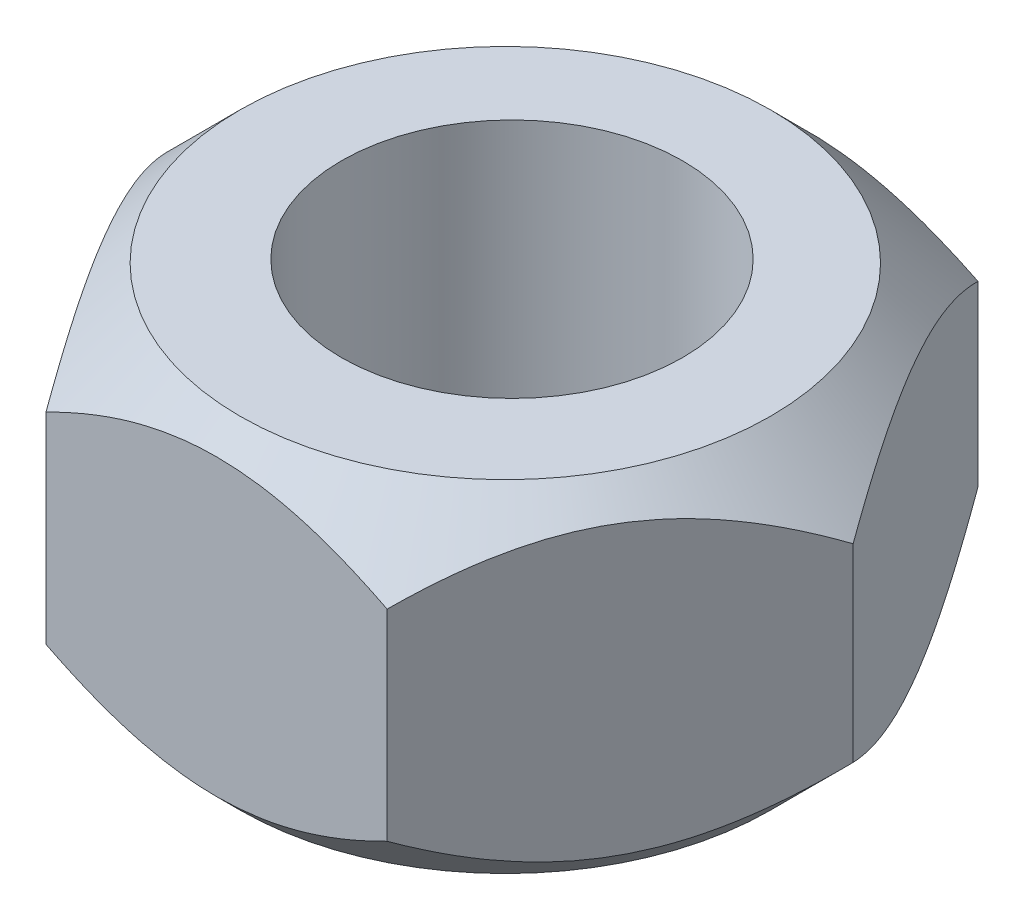
ISO-10303-21;
HEADER;
FILE_DESCRIPTION(('STEP AP214'),'2;1');
FILE_NAME('part.step','',(''),(''),'','','');
FILE_SCHEMA(('AUTOMOTIVE_DESIGN { 1 0 10303 214 1 1 1 1 }'));
ENDSEC;
DATA;
#1=APPLICATION_CONTEXT('core data for automotive mechanical design processes');
#2=APPLICATION_PROTOCOL_DEFINITION('international standard','automotive_design',2000,#1);
#3=PRODUCT_CONTEXT('',#1,'mechanical');
#4=PRODUCT('Part','Part','',(#3));
#5=PRODUCT_RELATED_PRODUCT_CATEGORY('part','',(#4));
#6=PRODUCT_DEFINITION_FORMATION('','',#4);
#7=PRODUCT_DEFINITION_CONTEXT('part definition',#1,'design');
#8=PRODUCT_DEFINITION('design','',#6,#7);
#9=PRODUCT_DEFINITION_SHAPE('','',#8);
#10=(LENGTH_UNIT() NAMED_UNIT(*) SI_UNIT(.MILLI.,.METRE.));
#11=(NAMED_UNIT(*) PLANE_ANGLE_UNIT() SI_UNIT($,.RADIAN.));
#12=(NAMED_UNIT(*) SI_UNIT($,.STERADIAN.) SOLID_ANGLE_UNIT());
#13=UNCERTAINTY_MEASURE_WITH_UNIT(LENGTH_MEASURE(1.E-05),#10,'distance_accuracy_value','');
#14=(GEOMETRIC_REPRESENTATION_CONTEXT(3) GLOBAL_UNCERTAINTY_ASSIGNED_CONTEXT((#13)) GLOBAL_UNIT_ASSIGNED_CONTEXT((#10,
#11,#12)) REPRESENTATION_CONTEXT('',''));
#15=CARTESIAN_POINT('',(0.,0.,0.));
#16=DIRECTION('',(0.,0.,1.));
#17=DIRECTION('',(1.,0.,0.));
#18=AXIS2_PLACEMENT_3D('',#15,#16,#17);
#19=CARTESIAN_POINT('',(0.,-4.5,0.));
#20=DIRECTION('',(0.,1.,0.));
#21=DIRECTION('',(0.,0.,1.));
#22=AXIS2_PLACEMENT_3D('',#19,#20,#21);
#23=PLANE('',#22);
#24=CARTESIAN_POINT('',(0.,-4.5,0.));
#25=DIRECTION('',(0.,1.,0.));
#26=DIRECTION('',(0.,0.,1.));
#27=AXIS2_PLACEMENT_3D('',#24,#25,#26);
#28=CIRCLE('',#27,4.5);
#29=CARTESIAN_POINT('',(0.,-4.5,4.5));
#30=VERTEX_POINT('',#29);
#31=EDGE_CURVE('E206',#30,#30,#28,.T.);
#32=ORIENTED_EDGE('',*,*,#31,.T.);
#33=EDGE_LOOP('',(#32));
#34=FACE_BOUND('',#33,.T.);
#35=CARTESIAN_POINT('',(0.,-4.5,0.176410187236797));
#36=DIRECTION('',(0.,1.,0.));
#37=DIRECTION('',(0.,0.,1.));
#38=AXIS2_PLACEMENT_3D('',#35,#36,#37);
#39=CIRCLE('',#38,7.);
#40=CARTESIAN_POINT('',(0.,-4.5,7.1764101872368));
#41=VERTEX_POINT('',#40);
#42=EDGE_CURVE('E99',#41,#41,#39,.T.);
#43=ORIENTED_EDGE('',*,*,#42,.F.);
#44=EDGE_LOOP('',(#43));
#45=FACE_BOUND('',#44,.T.);
#46=ADVANCED_FACE('F35',(#34,#45),#23,.F.);
#47=CARTESIAN_POINT('',(0.,4.5,0.));
#48=DIRECTION('',(0.,1.,0.));
#49=DIRECTION('',(0.,0.,1.));
#50=AXIS2_PLACEMENT_3D('',#47,#48,#49);
#51=PLANE('',#50);
#52=CARTESIAN_POINT('',(0.,4.5,0.));
#53=DIRECTION('',(0.,1.,0.));
#54=DIRECTION('',(0.,0.,1.));
#55=AXIS2_PLACEMENT_3D('',#52,#53,#54);
#56=CIRCLE('',#55,4.5);
#57=CARTESIAN_POINT('',(0.,4.5,4.5));
#58=VERTEX_POINT('',#57);
#59=EDGE_CURVE('E115',#58,#58,#56,.T.);
#60=ORIENTED_EDGE('',*,*,#59,.F.);
#61=EDGE_LOOP('',(#60));
#62=FACE_BOUND('',#61,.T.);
#63=CARTESIAN_POINT('',(0.,4.5,0.176410187236797));
#64=DIRECTION('',(0.,1.,0.));
#65=DIRECTION('',(0.,0.,1.));
#66=AXIS2_PLACEMENT_3D('',#63,#64,#65);
#67=CIRCLE('',#66,7.);
#68=CARTESIAN_POINT('',(0.,4.5,7.1764101872368));
#69=VERTEX_POINT('',#68);
#70=EDGE_CURVE('E135',#69,#69,#67,.T.);
#71=ORIENTED_EDGE('',*,*,#70,.T.);
#72=EDGE_LOOP('',(#71));
#73=FACE_BOUND('',#72,.T.);
#74=ADVANCED_FACE('F223',(#62,#73),#51,.T.);
#75=CARTESIAN_POINT('',(-9.,4.5,0.));
#76=DIRECTION('',(0.866025403784439,0.,-0.5));
#77=DIRECTION('',(-0.5,0.,-0.866025403784439));
#78=AXIS2_PLACEMENT_3D('',#75,#76,#77);
#79=PLANE('',#78);
#80=DIRECTION('',(0.,-1.,0.));
#81=VECTOR('',#80,1.);
#82=CARTESIAN_POINT('',(-9.,4.5,0.));
#83=LINE('',#82,#81);
#84=CARTESIAN_POINT('',(-9.,2.49827124635713,0.));
#85=VERTEX_POINT('',#84);
#86=CARTESIAN_POINT('',(-9.,-2.49827124635713,0.));
#87=VERTEX_POINT('',#86);
#88=EDGE_CURVE('E111',#85,#87,#83,.T.);
#89=ORIENTED_EDGE('',*,*,#88,.T.);
#90=CARTESIAN_POINT('',(-9.00011547005384,-2.49815187683451,-0.000200000000003557));
#91=CARTESIAN_POINT('',(-8.93337229885827,-2.56714256850482,0.115402563568986));
#92=CARTESIAN_POINT('',(-8.86618939973089,-2.63442769669181,0.231766758257374));
#93=CARTESIAN_POINT('',(-8.73086547058014,-2.76513381926847,0.466154679026334));
#94=CARTESIAN_POINT('',(-8.6627241448902,-2.82855358755477,0.584178917216407));
#95=CARTESIAN_POINT('',(-8.45631584914669,-3.01271009711185,0.941688572547873));
#96=CARTESIAN_POINT('',(-8.31654245608587,-3.12684225680212,1.1837831908755));
#97=CARTESIAN_POINT('',(-8.03364895449514,-3.33222552560905,1.67376910876171));
#98=CARTESIAN_POINT('',(-7.89055069869629,-3.4235955450618,1.92162255827982));
#99=CARTESIAN_POINT('',(-7.60081409665032,-3.57888751259915,2.42346107383581));
#100=CARTESIAN_POINT('',(-7.45418143243028,-3.642850768788,2.67743629831409));
#101=CARTESIAN_POINT('',(-7.19198594880458,-3.72782332233832,3.1315721974689));
#102=CARTESIAN_POINT('',(-7.07694611766506,-3.75529500958478,3.33082702989669));
#103=CARTESIAN_POINT('',(-6.846068137605,-3.78969507316318,3.73071942170959));
#104=CARTESIAN_POINT('',(-6.73022989201124,-3.79662091636565,3.93135714853763));
#105=CARTESIAN_POINT('',(-6.49877313299096,-3.78951842837021,4.33225201491597));
#106=CARTESIAN_POINT('',(-6.38315454136395,-3.77550004191797,4.53250928991352));
#107=CARTESIAN_POINT('',(-6.15299755855426,-3.72732125813097,4.93115287785666));
#108=CARTESIAN_POINT('',(-6.03845908969977,-3.69316232050288,5.12953932533378));
#109=CARTESIAN_POINT('',(-5.80103019777762,-3.60257535771685,5.54077822932773));
#110=CARTESIAN_POINT('',(-5.67830505834108,-3.54443414548947,5.75334440619778));
#111=CARTESIAN_POINT('',(-5.43546597282836,-3.4092438737114,6.17395404036938));
#112=CARTESIAN_POINT('',(-5.31535309511567,-3.33218723073932,6.38199564721107));
#113=CARTESIAN_POINT('',(-5.1371283649829,-3.20460646622877,6.69068993496628));
#114=CARTESIAN_POINT('',(-5.07793506268056,-3.15998524342402,6.79321574202172));
#115=CARTESIAN_POINT('',(-4.96028076876477,-3.06713953187502,6.99699895681251));
#116=CARTESIAN_POINT('',(-4.90181952895245,-3.01891630522313,7.09825679444091));
#117=CARTESIAN_POINT('',(-4.7857253585901,-2.91930744781386,7.29933779597107));
#118=CARTESIAN_POINT('',(-4.72809092690414,-2.86792878380103,7.3991635599165));
#119=CARTESIAN_POINT('',(-4.61348965924069,-2.76221452818367,7.59765877812139));
#120=CARTESIAN_POINT('',(-4.55652295618675,-2.7078783595878,7.69632800215051));
#121=CARTESIAN_POINT('',(-4.49988452994617,-2.65222254806404,7.79442863405994));
#122=B_SPLINE_CURVE_WITH_KNOTS('',3,(#90,#91,#92,#93,#94,#95,#96,#97,#98,#99,#100,#101,#102,
#103,#104,#105,#106,#107,#108,#109,#110,#111,#112,#113,#114,#115,#116,#117,#118,#119,#120,#121),
.UNSPECIFIED.,.F.,.F.,(4,2,2,2,2,2,2,2,2,2,2,2,2,2,2,4),(0.,0.450759112330253,0.901660470497774,
1.80669646427233,2.70690039837835,3.60574271044051,4.30004240636239,4.99442770003037,
5.68848339022319,6.38248878421534,7.1383383228642,7.89449138692641,8.27399382628616,
8.65336391143177,9.03192458213689,9.41055937433255),.UNSPECIFIED.);
#123=CARTESIAN_POINT('',(-4.5,-2.6523360208042,7.79422863405994));
#124=VERTEX_POINT('',#123);
#125=EDGE_CURVE('E56',#87,#124,#122,.T.);
#126=ORIENTED_EDGE('',*,*,#125,.T.);
#127=DIRECTION('',(0.,-1.,0.));
#128=VECTOR('',#127,1.);
#129=CARTESIAN_POINT('',(-4.5,4.5,7.79422863405994));
#130=LINE('',#129,#128);
#131=CARTESIAN_POINT('',(-4.5,2.6523360208042,7.79422863405994));
#132=VERTEX_POINT('',#131);
#133=EDGE_CURVE('E49',#132,#124,#130,.T.);
#134=ORIENTED_EDGE('',*,*,#133,.F.);
#135=CARTESIAN_POINT('',(-9.00011547005384,2.49815187683451,-0.000200000000003557));
#136=CARTESIAN_POINT('',(-8.93337229885827,2.56714256850482,0.115402563568986));
#137=CARTESIAN_POINT('',(-8.86618939973089,2.63442769669181,0.231766758257374));
#138=CARTESIAN_POINT('',(-8.73086547058014,2.76513381926847,0.466154679026334));
#139=CARTESIAN_POINT('',(-8.6627241448902,2.82855358755477,0.584178917216407));
#140=CARTESIAN_POINT('',(-8.45631584914669,3.01271009711185,0.941688572547873));
#141=CARTESIAN_POINT('',(-8.31654245608587,3.12684225680212,1.1837831908755));
#142=CARTESIAN_POINT('',(-8.03364895449514,3.33222552560905,1.67376910876171));
#143=CARTESIAN_POINT('',(-7.89055069869629,3.4235955450618,1.92162255827982));
#144=CARTESIAN_POINT('',(-7.60081409665032,3.57888751259915,2.42346107383581));
#145=CARTESIAN_POINT('',(-7.45418143243028,3.642850768788,2.67743629831409));
#146=CARTESIAN_POINT('',(-7.19198594880458,3.72782332233832,3.1315721974689));
#147=CARTESIAN_POINT('',(-7.07694611766506,3.75529500958478,3.33082702989669));
#148=CARTESIAN_POINT('',(-6.846068137605,3.78969507316318,3.73071942170959));
#149=CARTESIAN_POINT('',(-6.73022989201124,3.79662091636565,3.93135714853763));
#150=CARTESIAN_POINT('',(-6.49877313299096,3.78951842837021,4.33225201491597));
#151=CARTESIAN_POINT('',(-6.38315454136395,3.77550004191797,4.53250928991352));
#152=CARTESIAN_POINT('',(-6.15299755855426,3.72732125813097,4.93115287785666));
#153=CARTESIAN_POINT('',(-6.03845908969977,3.69316232050288,5.12953932533378));
#154=CARTESIAN_POINT('',(-5.80103019777762,3.60257535771685,5.54077822932773));
#155=CARTESIAN_POINT('',(-5.67830505834108,3.54443414548947,5.75334440619778));
#156=CARTESIAN_POINT('',(-5.43546597282836,3.4092438737114,6.17395404036938));
#157=CARTESIAN_POINT('',(-5.31535309511567,3.33218723073932,6.38199564721107));
#158=CARTESIAN_POINT('',(-5.1371283649829,3.20460646622877,6.69068993496628));
#159=CARTESIAN_POINT('',(-5.07793506268056,3.15998524342402,6.79321574202172));
#160=CARTESIAN_POINT('',(-4.96028076876477,3.06713953187502,6.99699895681251));
#161=CARTESIAN_POINT('',(-4.90181952895245,3.01891630522313,7.09825679444091));
#162=CARTESIAN_POINT('',(-4.7857253585901,2.91930744781386,7.29933779597107));
#163=CARTESIAN_POINT('',(-4.72809092690414,2.86792878380103,7.3991635599165));
#164=CARTESIAN_POINT('',(-4.61348965924069,2.76221452818367,7.59765877812139));
#165=CARTESIAN_POINT('',(-4.55652295618675,2.7078783595878,7.69632800215051));
#166=CARTESIAN_POINT('',(-4.49988452994617,2.65222254806404,7.79442863405994));
#167=B_SPLINE_CURVE_WITH_KNOTS('',3,(#135,#136,#137,#138,#139,#140,#141,#142,#143,#144,#145,
#146,#147,#148,#149,#150,#151,#152,#153,#154,#155,#156,#157,#158,#159,#160,#161,#162,#163,#164,
#165,#166),.UNSPECIFIED.,.F.,.F.,(4,2,2,2,2,2,2,2,2,2,2,2,2,2,2,4),(0.,0.450759112330253,
0.901660470497774,1.80669646427233,2.70690039837835,3.60574271044051,4.30004240636239,
4.99442770003037,5.68848339022319,6.38248878421534,7.1383383228642,7.89449138692641,
8.27399382628616,8.65336391143177,9.03192458213689,9.41055937433255),.UNSPECIFIED.);
#168=EDGE_CURVE('E134',#85,#132,#167,.T.);
#169=ORIENTED_EDGE('',*,*,#168,.F.);
#170=EDGE_LOOP('',(#89,#126,#134,#169));
#171=FACE_BOUND('',#170,.T.);
#172=ADVANCED_FACE('F37',(#171),#79,.F.);
#173=CARTESIAN_POINT('',(-4.5,4.5,7.79422863405994));
#174=DIRECTION('',(0.,0.,-1.));
#175=DIRECTION('',(-1.,0.,0.));
#176=AXIS2_PLACEMENT_3D('',#173,#174,#175);
#177=PLANE('',#176);
#178=ORIENTED_EDGE('',*,*,#133,.T.);
#179=CARTESIAN_POINT('',(-9.20136140768699,0.445551876896696,7.79422863405994));
#180=CARTESIAN_POINT('',(-8.97914837298663,0.274425109326397,7.79422863405994));
#181=CARTESIAN_POINT('',(-8.7557406061249,0.104825403909098,7.79422863405994));
#182=CARTESIAN_POINT('',(-8.30604635651759,-0.230621466903462,7.79422863405994));
#183=CARTESIAN_POINT('',(-8.07975920735091,-0.396467737962096,7.79422863405994));
#184=CARTESIAN_POINT('',(-7.62216357374761,-0.724889483219535,7.79422863405994));
#185=CARTESIAN_POINT('',(-7.39082982286902,-0.887429868117445,7.79422863405994));
#186=CARTESIAN_POINT('',(-6.92431672431694,-1.20687587846623,7.79422863405994));
#187=CARTESIAN_POINT('',(-6.68913764272439,-1.36378189141101,7.79422863405994));
#188=CARTESIAN_POINT('',(-6.19914604354433,-1.68045824918257,7.79422863405994));
#189=CARTESIAN_POINT('',(-5.9440378007248,-1.83977331431898,7.79422863405994));
#190=CARTESIAN_POINT('',(-5.42782902061459,-2.14854641934991,7.79422863405994));
#191=CARTESIAN_POINT('',(-5.16672748161128,-2.29800279506396,7.79422863405994));
#192=CARTESIAN_POINT('',(-4.63845542163731,-2.5838780167467,7.79422863405994));
#193=CARTESIAN_POINT('',(-4.37130577101298,-2.72033512770015,7.79422863405994));
#194=CARTESIAN_POINT('',(-3.82944026005793,-2.97715444785614,7.79422863405994));
#195=CARTESIAN_POINT('',(-3.55472805137934,-3.09752426609555,7.79422863405994));
#196=CARTESIAN_POINT('',(-3.02490633621103,-3.30682694655788,7.79422863405994));
#197=CARTESIAN_POINT('',(-2.77056992326075,-3.39769691258547,7.79422863405994));
#198=CARTESIAN_POINT('',(-2.2553979051561,-3.55908071415559,7.79422863405994));
#199=CARTESIAN_POINT('',(-1.99456188885429,-3.62959325837315,7.79422863405994));
#200=CARTESIAN_POINT('',(-1.47250304577357,-3.74526215278894,7.79422863405994));
#201=CARTESIAN_POINT('',(-1.21138433534678,-3.79088051125355,7.79422863405994));
#202=CARTESIAN_POINT('',(-0.685877853740609,-3.85580599206309,7.79422863405994));
#203=CARTESIAN_POINT('',(-0.421490779490118,-3.87511862927985,7.79422863405994));
#204=CARTESIAN_POINT('',(0.0961693345565799,-3.88577603739925,7.79422863405994));
#205=CARTESIAN_POINT('',(0.349417951644816,-3.87831742533656,7.79422863405994));
#206=CARTESIAN_POINT('',(0.853949140615908,-3.83859637106765,7.79422863405994));
#207=CARTESIAN_POINT('',(1.10523153259592,-3.80633168538911,7.79422863405994));
#208=CARTESIAN_POINT('',(1.60827108954547,-3.71827798352654,7.79422863405994));
#209=CARTESIAN_POINT('',(1.85995415680987,-3.66207279297498,7.79422863405994));
#210=CARTESIAN_POINT('',(2.35777410415219,-3.5292630254232,7.79422863405994));
#211=CARTESIAN_POINT('',(2.60391128982613,-3.45265957542935,7.79422863405994));
#212=CARTESIAN_POINT('',(3.10375473620564,-3.27767797551394,7.79422863405994));
#213=CARTESIAN_POINT('',(3.35711466748442,-3.17832178667244,7.79422863405994));
#214=CARTESIAN_POINT('',(3.85732043590709,-2.96425535623311,7.79422863405994));
#215=CARTESIAN_POINT('',(4.10416328036522,-2.84953820270588,7.79422863405994));
#216=CARTESIAN_POINT('',(4.59249872790353,-2.60747000055304,7.79422863405994));
#217=CARTESIAN_POINT('',(4.83397190341971,-2.48008007799119,7.79422863405994));
#218=CARTESIAN_POINT('',(5.31138606717909,-2.21546909981417,7.79422863405994));
#219=CARTESIAN_POINT('',(5.54732789850603,-2.07824955552476,7.79422863405994));
#220=CARTESIAN_POINT('',(6.00287359514048,-1.80286709972634,7.79422863405994));
#221=CARTESIAN_POINT('',(6.22270899983805,-1.66508518347705,7.79422863405994));
#222=CARTESIAN_POINT('',(6.65860276969025,-1.38365359186703,7.79422863405994));
#223=CARTESIAN_POINT('',(6.87466085008166,-1.24000347681773,7.79422863405994));
#224=CARTESIAN_POINT('',(7.30175781154501,-0.949050442492573,7.79422863405994));
#225=CARTESIAN_POINT('',(7.51282305634431,-0.80178608401215,7.79422863405994));
#226=CARTESIAN_POINT('',(7.93205755204296,-0.503307407770096,7.79422863405994));
#227=CARTESIAN_POINT('',(8.14022758527894,-0.352094190139551,7.79422863405994));
#228=CARTESIAN_POINT('',(8.34718302934675,-0.199264518883163,7.79422863405994));
#229=B_SPLINE_CURVE_WITH_KNOTS('',3,(#179,#180,#181,#182,#183,#184,#185,#186,#187,#188,#189,
#190,#191,#192,#193,#194,#195,#196,#197,#198,#199,#200,#201,#202,#203,#204,#205,#206,#207,#208,
#209,#210,#211,#212,#213,#214,#215,#216,#217,#218,#219,#220,#221,#222,#223,#224,#225,#226,#227,
#228),.UNSPECIFIED.,.F.,.F.,(4,2,2,2,2,2,2,2,2,2,2,2,2,2,2,2,2,2,2,2,2,2,2,2,4),(0.,
0.84142313817018,1.68304469657708,2.53115701628342,3.37921089642842,4.28133835285118,
5.1836177038219,6.08315322464844,6.98226176209174,7.7918105489826,8.60141067641212,
9.39542489876225,10.1892726340982,10.9480876989148,11.7069713993765,12.4796232876686,
13.2522324957022,14.0680425150267,14.8842208634124,15.7029849390835,16.5216233970786,
17.2998477798365,18.0781305802208,18.8501681987295,19.621992979169),.UNSPECIFIED.);
#230=CARTESIAN_POINT('',(4.5,-2.6523360208042,7.79422863405994));
#231=VERTEX_POINT('',#230);
#232=EDGE_CURVE('E130',#124,#231,#229,.T.);
#233=ORIENTED_EDGE('',*,*,#232,.T.);
#234=DIRECTION('',(0.,-1.,0.));
#235=VECTOR('',#234,1.);
#236=CARTESIAN_POINT('',(4.5,4.5,7.79422863405994));
#237=LINE('',#236,#235);
#238=CARTESIAN_POINT('',(4.5,2.6523360208042,7.79422863405994));
#239=VERTEX_POINT('',#238);
#240=EDGE_CURVE('E121',#239,#231,#237,.T.);
#241=ORIENTED_EDGE('',*,*,#240,.F.);
#242=CARTESIAN_POINT('',(-9.2138223929341,-0.455152904806044,7.79422863405994));
#243=CARTESIAN_POINT('',(-8.9913559480122,-0.283736728158094,7.79422863405994));
#244=CARTESIAN_POINT('',(-8.76769482671362,-0.11384672861024,7.79422863405994));
#245=CARTESIAN_POINT('',(-8.31749349790607,0.222182492895005,7.79422863405994));
#246=CARTESIAN_POINT('',(-8.09095262506989,0.388320822527197,7.79422863405994));
#247=CARTESIAN_POINT('',(-7.63284699531532,0.717330470055217,7.79422863405994));
#248=CARTESIAN_POINT('',(-7.40125696960968,0.880166718931785,7.79422863405994));
#249=CARTESIAN_POINT('',(-6.93422951825987,1.20020602832322,7.79422863405994));
#250=CARTESIAN_POINT('',(-6.69879235863891,1.35740947595736,7.79422863405994));
#251=CARTESIAN_POINT('',(-6.20821891884639,1.67473049012099,7.79422863405994));
#252=CARTESIAN_POINT('',(-5.95278578157262,1.83439142041222,7.79422863405994));
#253=CARTESIAN_POINT('',(-5.43591879884884,2.14385199490385,7.79422863405994));
#254=CARTESIAN_POINT('',(-5.17448394854582,2.29364997129151,7.79422863405994));
#255=CARTESIAN_POINT('',(-4.64553387839459,2.58019816812334,7.79422863405994));
#256=CARTESIAN_POINT('',(-4.37803956549673,2.71698667973802,7.79422863405994));
#257=CARTESIAN_POINT('',(-3.83546725611791,2.97445110872806,7.79422863405994));
#258=CARTESIAN_POINT('',(-3.56039292405627,3.09513465242631,7.79422863405994));
#259=CARTESIAN_POINT('',(-3.03000524797311,3.30494638001034,7.79422863405994));
#260=CARTESIAN_POINT('',(-2.77547106002611,3.39602421091159,7.79422863405994));
#261=CARTESIAN_POINT('',(-2.25988780519022,3.55780894442859,7.79422863405994));
#262=CARTESIAN_POINT('',(-1.99883832706251,3.62851455761823,7.79422863405994));
#263=CARTESIAN_POINT('',(-1.47634830264216,3.7445367279363,7.79422863405994));
#264=CARTESIAN_POINT('',(-1.21501242407444,3.79031670073349,7.79422863405994));
#265=CARTESIAN_POINT('',(-0.68905529086126,3.85552733497336,7.79422863405994));
#266=CARTESIAN_POINT('',(-0.424434740555332,3.87496355012986,7.79422863405994));
#267=CARTESIAN_POINT('',(0.0936280935442415,3.88581309005412,7.79422863405994));
#268=CARTESIAN_POINT('',(0.347045345927264,3.87843164065731,7.79422863405994));
#269=CARTESIAN_POINT('',(0.851918043890905,3.83882826608877,7.79422863405994));
#270=CARTESIAN_POINT('',(1.10337331037325,3.80660409935791,7.79422863405994));
#271=CARTESIAN_POINT('',(1.60676497717226,3.71859513051218,7.79422863405994));
#272=CARTESIAN_POINT('',(1.85862717010115,3.66239304657436,7.79422863405994));
#273=CARTESIAN_POINT('',(2.35679938802545,3.52955670710539,7.79422863405994));
#274=CARTESIAN_POINT('',(2.60310971425917,3.45292356304993,7.79422863405994));
#275=CARTESIAN_POINT('',(3.10306124309103,3.27793825318887,7.79422863405994));
#276=CARTESIAN_POINT('',(3.35636191453859,3.17862427168576,7.79422863405994));
#277=CARTESIAN_POINT('',(3.85645217965975,2.96464654737887,7.79422863405994));
#278=CARTESIAN_POINT('',(4.10323878470592,2.84997590065268,7.79422863405994));
#279=CARTESIAN_POINT('',(4.59146349499502,2.60800372461428,7.79422863405994));
#280=CARTESIAN_POINT('',(4.83288219104548,2.48066335161011,7.79422863405994));
#281=CARTESIAN_POINT('',(5.31018920929416,2.21615307331348,7.79422863405994));
#282=CARTESIAN_POINT('',(5.54607837359191,2.07898467782087,7.79422863405994));
#283=CARTESIAN_POINT('',(6.00152427432861,1.80370189242064,7.79422863405994));
#284=CARTESIAN_POINT('',(6.22131245590359,1.66596839702326,7.79422863405994));
#285=CARTESIAN_POINT('',(6.65711253748247,1.38463407169915,7.79422863405994));
#286=CARTESIAN_POINT('',(6.87312415286662,1.24103280224794,7.79422863405994));
#287=CARTESIAN_POINT('',(7.30012961938923,0.950176911019662,7.79422863405994));
#288=CARTESIAN_POINT('',(7.51114982189549,0.802960836562391,7.79422863405994));
#289=CARTESIAN_POINT('',(7.93029460308296,0.504578783785804,7.79422863405994));
#290=CARTESIAN_POINT('',(8.13841996402804,0.353413905616116,7.79422863405994));
#291=CARTESIAN_POINT('',(8.34533084059803,0.200632551872856,7.79422863405994));
#292=B_SPLINE_CURVE_WITH_KNOTS('',3,(#242,#243,#244,#245,#246,#247,#248,#249,#250,#251,#252,
#253,#254,#255,#256,#257,#258,#259,#260,#261,#262,#263,#264,#265,#266,#267,#268,#269,#270,#271,
#272,#273,#274,#275,#276,#277,#278,#279,#280,#281,#282,#283,#284,#285,#286,#287,#288,#289,#290,
#291),.UNSPECIFIED.,.F.,.F.,(4,2,2,2,2,2,2,2,2,2,2,2,2,2,2,2,2,2,2,2,2,2,2,2,4),(0.,
0.842555220232061,1.68530877312689,2.53456059427607,3.38375393745248,4.28725786387325,
5.19091418132518,6.09182261180921,6.99230290202756,7.80262004055825,8.61298845552245,
9.40772591417868,10.2022958025381,10.9616071743441,11.7209870668573,12.4941589177134,
13.2672887156156,14.0828874281607,14.8988540495151,15.7174042765328,16.5358290247832,
17.3138562240601,18.0919418085311,18.8637857172614,19.6354168341468),.UNSPECIFIED.);
#293=EDGE_CURVE('E131',#132,#239,#292,.T.);
#294=ORIENTED_EDGE('',*,*,#293,.F.);
#295=EDGE_LOOP('',(#178,#233,#241,#294));
#296=FACE_BOUND('',#295,.T.);
#297=ADVANCED_FACE('F128',(#296),#177,.F.);
#298=CARTESIAN_POINT('',(4.5,4.5,7.79422863405994));
#299=DIRECTION('',(-0.866025403784438,0.,-0.5));
#300=DIRECTION('',(-0.5,0.,0.866025403784439));
#301=AXIS2_PLACEMENT_3D('',#298,#299,#300);
#302=PLANE('',#301);
#303=ORIENTED_EDGE('',*,*,#240,.T.);
#304=CARTESIAN_POINT('',(4.49988452994616,-2.65222254806404,7.79442863405994));
#305=CARTESIAN_POINT('',(4.57494028066695,-2.72597104378169,7.66442826041131));
#306=CARTESIAN_POINT('',(4.65056596567208,-2.79740351523944,7.53344073162522));
#307=CARTESIAN_POINT('',(4.80306198549416,-2.93495144630993,7.26930987734135));
#308=CARTESIAN_POINT('',(4.87993295054447,-3.00106410573776,7.13616546024736));
#309=CARTESIAN_POINT('',(5.11323098625881,-3.19091470700184,6.7320814090841));
#310=CARTESIAN_POINT('',(5.27159025117158,-3.30540925029731,6.45779511640592));
#311=CARTESIAN_POINT('',(5.59063614966137,-3.5010113031031,5.90519141027516));
#312=CARTESIAN_POINT('',(5.7512399373909,-3.58264372222394,5.6270174900396));
#313=CARTESIAN_POINT('',(5.99467261679133,-3.67687677662381,5.20537972109543));
#314=CARTESIAN_POINT('',(6.07616268382649,-3.70357369271238,5.06423478467833));
#315=CARTESIAN_POINT('',(6.2397991237425,-3.74698244252793,4.78080815677412));
#316=CARTESIAN_POINT('',(6.32194540652537,-3.76369562392388,4.63852662134127));
#317=CARTESIAN_POINT('',(6.524718367277,-3.79196108003696,4.28731355091828));
#318=CARTESIAN_POINT('',(6.64556720397421,-3.79754950093281,4.07799722572311));
#319=CARTESIAN_POINT('',(6.88701643687654,-3.78594546277362,3.65979488688775));
#320=CARTESIAN_POINT('',(7.00761673626508,-3.76874536964626,3.45090904093877));
#321=CARTESIAN_POINT('',(7.24775028120362,-3.71255340524687,3.0349855405036));
#322=CARTESIAN_POINT('',(7.36728110952535,-3.6735208419167,2.82795207277957));
#323=CARTESIAN_POINT('',(7.60427524375837,-3.57576445201685,2.41746619119218));
#324=CARTESIAN_POINT('',(7.72173867636615,-3.51704183656862,2.21401355788407));
#325=CARTESIAN_POINT('',(7.93885035931915,-3.39143947471152,1.83796509209269));
#326=CARTESIAN_POINT('',(8.03880658445319,-3.32665416897879,1.66483583162773));
#327=CARTESIAN_POINT('',(8.23675805443204,-3.1860202787288,1.32197382819142));
#328=CARTESIAN_POINT('',(8.33475302523652,-3.11017016026224,1.15224155987183));
#329=CARTESIAN_POINT('',(8.52841383491766,-2.9493870003485,0.816811198069166));
#330=CARTESIAN_POINT('',(8.62408702382671,-2.86448904923116,0.651100373956558));
#331=CARTESIAN_POINT('',(8.81350189307533,-2.68685696671736,0.32302419670893));
#332=CARTESIAN_POINT('',(8.90724516543473,-2.59412964482692,0.160656086114693));
#333=CARTESIAN_POINT('',(9.00011547005384,-2.49815187683451,-0.000200000000001988));
#334=B_SPLINE_CURVE_WITH_KNOTS('',3,(#304,#305,#306,#307,#308,#309,#310,#311,#312,#313,#314,
#315,#316,#317,#318,#319,#320,#321,#322,#323,#324,#325,#326,#327,#328,#329,#330,#331,#332,#333),
.UNSPECIFIED.,.F.,.F.,(4,2,2,2,2,2,2,2,2,2,2,2,2,2,4),(0.,0.501717777992727,1.0036979403199,
2.01270061110579,3.00487759337195,3.50006537059055,3.99518628905155,4.71934578220673,
5.44374792760212,6.16950475768817,6.89521695516155,7.52530343181989,8.15547734247946,
8.78329053467258,9.41056320973886),.UNSPECIFIED.);
#335=CARTESIAN_POINT('',(9.,-2.49827124635714,0.));
#336=VERTEX_POINT('',#335);
#337=EDGE_CURVE('E139',#231,#336,#334,.T.);
#338=ORIENTED_EDGE('',*,*,#337,.T.);
#339=DIRECTION('',(0.,-1.,0.));
#340=VECTOR('',#339,1.);
#341=CARTESIAN_POINT('',(9.,4.5,0.));
#342=LINE('',#341,#340);
#343=CARTESIAN_POINT('',(9.,2.49827124635714,0.));
#344=VERTEX_POINT('',#343);
#345=EDGE_CURVE('E113',#344,#336,#342,.T.);
#346=ORIENTED_EDGE('',*,*,#345,.F.);
#347=CARTESIAN_POINT('',(4.49988452994616,2.65222254806404,7.79442863405994));
#348=CARTESIAN_POINT('',(4.57494028066695,2.72597104378169,7.66442826041131));
#349=CARTESIAN_POINT('',(4.65056596567208,2.79740351523944,7.53344073162523));
#350=CARTESIAN_POINT('',(4.80306198549416,2.93495144630993,7.26930987734135));
#351=CARTESIAN_POINT('',(4.87993295054447,3.00106410573776,7.13616546024736));
#352=CARTESIAN_POINT('',(5.11323098625881,3.19091470700184,6.7320814090841));
#353=CARTESIAN_POINT('',(5.27159025117158,3.30540925029731,6.45779511640592));
#354=CARTESIAN_POINT('',(5.59063614966137,3.5010113031031,5.90519141027516));
#355=CARTESIAN_POINT('',(5.7512399373909,3.58264372222394,5.6270174900396));
#356=CARTESIAN_POINT('',(5.99467261679133,3.67687677662381,5.20537972109543));
#357=CARTESIAN_POINT('',(6.07616268382649,3.70357369271238,5.06423478467833));
#358=CARTESIAN_POINT('',(6.2397991237425,3.74698244252793,4.78080815677412));
#359=CARTESIAN_POINT('',(6.32194540652537,3.76369562392388,4.63852662134127));
#360=CARTESIAN_POINT('',(6.524718367277,3.79196108003696,4.28731355091828));
#361=CARTESIAN_POINT('',(6.64556720397421,3.79754950093281,4.07799722572311));
#362=CARTESIAN_POINT('',(6.88701643687654,3.78594546277362,3.65979488688775));
#363=CARTESIAN_POINT('',(7.00761673626508,3.76874536964626,3.45090904093877));
#364=CARTESIAN_POINT('',(7.24775028120362,3.71255340524688,3.0349855405036));
#365=CARTESIAN_POINT('',(7.36728110952535,3.6735208419167,2.82795207277957));
#366=CARTESIAN_POINT('',(7.60427524375837,3.57576445201685,2.41746619119218));
#367=CARTESIAN_POINT('',(7.72173867636615,3.51704183656862,2.21401355788407));
#368=CARTESIAN_POINT('',(7.93885035931915,3.39143947471152,1.83796509209269));
#369=CARTESIAN_POINT('',(8.03880658445319,3.32665416897879,1.66483583162773));
#370=CARTESIAN_POINT('',(8.23675805443204,3.1860202787288,1.32197382819142));
#371=CARTESIAN_POINT('',(8.33475302523652,3.11017016026225,1.15224155987182));
#372=CARTESIAN_POINT('',(8.52841383491766,2.9493870003485,0.816811198069165));
#373=CARTESIAN_POINT('',(8.62408702382671,2.86448904923116,0.651100373956558));
#374=CARTESIAN_POINT('',(8.81350189307533,2.68685696671736,0.32302419670893));
#375=CARTESIAN_POINT('',(8.90724516543473,2.59412964482692,0.160656086114694));
#376=CARTESIAN_POINT('',(9.00011547005384,2.49815187683451,-0.000200000000001988));
#377=B_SPLINE_CURVE_WITH_KNOTS('',3,(#347,#348,#349,#350,#351,#352,#353,#354,#355,#356,#357,
#358,#359,#360,#361,#362,#363,#364,#365,#366,#367,#368,#369,#370,#371,#372,#373,#374,#375,#376),
.UNSPECIFIED.,.F.,.F.,(4,2,2,2,2,2,2,2,2,2,2,2,2,2,4),(0.,0.501717777992726,1.0036979403199,
2.01270061110579,3.00487759337195,3.50006537059055,3.99518628905155,4.71934578220673,
5.44374792760212,6.16950475768817,6.89521695516155,7.5253034318199,8.15547734247947,
8.78329053467258,9.41056320973886),.UNSPECIFIED.);
#378=EDGE_CURVE('E188',#239,#344,#377,.T.);
#379=ORIENTED_EDGE('',*,*,#378,.F.);
#380=EDGE_LOOP('',(#303,#338,#346,#379));
#381=FACE_BOUND('',#380,.T.);
#382=ADVANCED_FACE('F179',(#381),#302,.F.);
#383=CARTESIAN_POINT('',(9.,4.5,0.));
#384=DIRECTION('',(-0.866025403784439,0.,0.5));
#385=DIRECTION('',(0.5,0.,0.866025403784439));
#386=AXIS2_PLACEMENT_3D('',#383,#384,#385);
#387=PLANE('',#386);
#388=ORIENTED_EDGE('',*,*,#345,.T.);
#389=CARTESIAN_POINT('',(9.00011547005383,-2.49815971568101,0.000199999999999739));
#390=CARTESIAN_POINT('',(8.92475542321022,-2.5709405060579,-0.130327429993905));
#391=CARTESIAN_POINT('',(8.84883036392258,-2.64138475617119,-0.261833490247788));
#392=CARTESIAN_POINT('',(8.69575318524924,-2.77692820681009,-0.526970941189303));
#393=CARTESIAN_POINT('',(8.6186004673504,-2.84202469854446,-0.660603368532123));
#394=CARTESIAN_POINT('',(8.38453982939357,-3.02875896929195,-1.06600828552533));
#395=CARTESIAN_POINT('',(8.22573592022995,-3.14114454403668,-1.34106472463728));
#396=CARTESIAN_POINT('',(7.90582966285746,-3.33285751287599,-1.89515861606564));
#397=CARTESIAN_POINT('',(7.7448038884195,-3.41268164368128,-2.17406343872031));
#398=CARTESIAN_POINT('',(7.50083731129932,-3.504579872745,-2.59662594564113));
#399=CARTESIAN_POINT('',(7.41918064235874,-3.53056269847925,-2.73805944502305));
#400=CARTESIAN_POINT('',(7.25524148937797,-3.57270519776419,-3.02201038733555));
#401=CARTESIAN_POINT('',(7.17295908325258,-3.58886607467299,-3.16452769531375));
#402=CARTESIAN_POINT('',(6.9673718387427,-3.61634396030411,-3.52061524819294));
#403=CARTESIAN_POINT('',(6.84384038951713,-3.6213456830198,-3.73457799458424));
#404=CARTESIAN_POINT('',(6.59706582831677,-3.60809311697772,-4.16200407259879));
#405=CARTESIAN_POINT('',(6.47382282425002,-3.58983119697579,-4.37546721731981));
#406=CARTESIAN_POINT('',(6.22846662927994,-3.53110264569099,-4.80043661295976));
#407=CARTESIAN_POINT('',(6.10635581617731,-3.49059688350881,-5.01193874540707));
#408=CARTESIAN_POINT('',(5.86426222399194,-3.38955003066352,-5.431257147259));
#409=CARTESIAN_POINT('',(5.74427930634834,-3.32901024962745,-5.63907365665805));
#410=CARTESIAN_POINT('',(5.52804264105124,-3.20297031742239,-6.0136065474119));
#411=CARTESIAN_POINT('',(5.43137222637376,-3.14027904693199,-6.18104461722205));
#412=CARTESIAN_POINT('',(5.23982818805206,-3.00474510899824,-6.51280862348216));
#413=CARTESIAN_POINT('',(5.14495468027909,-2.93190178942737,-6.67713435923723));
#414=CARTESIAN_POINT('',(4.95736898917099,-2.77781526456242,-7.00204230700938));
#415=CARTESIAN_POINT('',(4.86464991359972,-2.69660533717327,-7.16263645672962));
#416=CARTESIAN_POINT('',(4.68097949732208,-2.52684695582505,-7.48076294956984));
#417=CARTESIAN_POINT('',(4.59002698818318,-2.43830357158591,-7.63829731647428));
#418=CARTESIAN_POINT('',(4.49988452994616,-2.34668189682343,-7.79442863405994));
#419=B_SPLINE_CURVE_WITH_KNOTS('',3,(#389,#390,#391,#392,#393,#394,#395,#396,#397,#398,#399,
#400,#401,#402,#403,#404,#405,#406,#407,#408,#409,#410,#411,#412,#413,#414,#415,#416,#417,#418),
.UNSPECIFIED.,.F.,.F.,(4,2,2,2,2,2,2,2,2,2,2,2,2,2,4),(0.,0.502087520793748,1.00442781486842,
2.01382316899706,3.00718543747708,3.50302746644217,3.99880873395595,4.73899522990135,
5.47942459403111,6.22116069806602,6.9628483242675,7.57229770762298,8.18178625765945,
8.78893789397962,9.39567324646988),.UNSPECIFIED.);
#420=CARTESIAN_POINT('',(4.5,-2.34679929098227,-7.79422863405994));
#421=VERTEX_POINT('',#420);
#422=EDGE_CURVE('E108',#336,#421,#419,.T.);
#423=ORIENTED_EDGE('',*,*,#422,.T.);
#424=DIRECTION('',(0.,-1.,0.));
#425=VECTOR('',#424,1.);
#426=CARTESIAN_POINT('',(4.5,4.5,-7.79422863405994));
#427=LINE('',#426,#425);
#428=CARTESIAN_POINT('',(4.5,2.34679929098228,-7.79422863405994));
#429=VERTEX_POINT('',#428);
#430=EDGE_CURVE('E107',#429,#421,#427,.T.);
#431=ORIENTED_EDGE('',*,*,#430,.F.);
#432=CARTESIAN_POINT('',(9.00011547005383,2.49815971568101,0.000199999999999739));
#433=CARTESIAN_POINT('',(8.92475542321022,2.5709405060579,-0.130327429993905));
#434=CARTESIAN_POINT('',(8.84883036392258,2.64138475617119,-0.261833490247788));
#435=CARTESIAN_POINT('',(8.69575318524924,2.77692820681009,-0.526970941189303));
#436=CARTESIAN_POINT('',(8.6186004673504,2.84202469854446,-0.660603368532123));
#437=CARTESIAN_POINT('',(8.38453982939357,3.02875896929195,-1.06600828552533));
#438=CARTESIAN_POINT('',(8.22573592022995,3.14114454403668,-1.34106472463728));
#439=CARTESIAN_POINT('',(7.90582966285746,3.33285751287599,-1.89515861606564));
#440=CARTESIAN_POINT('',(7.7448038884195,3.41268164368128,-2.17406343872031));
#441=CARTESIAN_POINT('',(7.50083731129932,3.504579872745,-2.59662594564113));
#442=CARTESIAN_POINT('',(7.41918064235874,3.53056269847925,-2.73805944502305));
#443=CARTESIAN_POINT('',(7.25524148937797,3.57270519776419,-3.02201038733555));
#444=CARTESIAN_POINT('',(7.17295908325258,3.58886607467299,-3.16452769531375));
#445=CARTESIAN_POINT('',(6.9673718387427,3.61634396030411,-3.52061524819294));
#446=CARTESIAN_POINT('',(6.84384038951713,3.6213456830198,-3.73457799458424));
#447=CARTESIAN_POINT('',(6.59706582831677,3.60809311697772,-4.16200407259879));
#448=CARTESIAN_POINT('',(6.47382282425002,3.58983119697579,-4.37546721731981));
#449=CARTESIAN_POINT('',(6.22846662927994,3.53110264569099,-4.80043661295976));
#450=CARTESIAN_POINT('',(6.10635581617731,3.49059688350881,-5.01193874540707));
#451=CARTESIAN_POINT('',(5.86426222399194,3.38955003066352,-5.431257147259));
#452=CARTESIAN_POINT('',(5.74427930634834,3.32901024962745,-5.63907365665805));
#453=CARTESIAN_POINT('',(5.52804264105124,3.20297031742239,-6.0136065474119));
#454=CARTESIAN_POINT('',(5.43137222637376,3.14027904693199,-6.18104461722205));
#455=CARTESIAN_POINT('',(5.23982818805206,3.00474510899824,-6.51280862348216));
#456=CARTESIAN_POINT('',(5.14495468027909,2.93190178942737,-6.67713435923723));
#457=CARTESIAN_POINT('',(4.95736898917099,2.77781526456242,-7.00204230700938));
#458=CARTESIAN_POINT('',(4.86464991359972,2.69660533717327,-7.16263645672962));
#459=CARTESIAN_POINT('',(4.68097949732208,2.52684695582505,-7.48076294956984));
#460=CARTESIAN_POINT('',(4.59002698818318,2.43830357158591,-7.63829731647428));
#461=CARTESIAN_POINT('',(4.49988452994616,2.34668189682343,-7.79442863405994));
#462=B_SPLINE_CURVE_WITH_KNOTS('',3,(#432,#433,#434,#435,#436,#437,#438,#439,#440,#441,#442,
#443,#444,#445,#446,#447,#448,#449,#450,#451,#452,#453,#454,#455,#456,#457,#458,#459,#460,#461),
.UNSPECIFIED.,.F.,.F.,(4,2,2,2,2,2,2,2,2,2,2,2,2,2,4),(0.,0.502087520793748,1.00442781486842,
2.01382316899706,3.00718543747708,3.50302746644217,3.99880873395595,4.73899522990135,
5.47942459403111,6.22116069806602,6.9628483242675,7.57229770762298,8.18178625765945,
8.78893789397962,9.39567324646988),.UNSPECIFIED.);
#463=EDGE_CURVE('E194',#344,#429,#462,.T.);
#464=ORIENTED_EDGE('',*,*,#463,.F.);
#465=EDGE_LOOP('',(#388,#423,#431,#464));
#466=FACE_BOUND('',#465,.T.);
#467=ADVANCED_FACE('F182',(#466),#387,.F.);
#468=CARTESIAN_POINT('',(4.5,4.5,-7.79422863405994));
#469=DIRECTION('',(0.,0.,1.));
#470=DIRECTION('',(1.,0.,0.));
#471=AXIS2_PLACEMENT_3D('',#468,#469,#470);
#472=PLANE('',#471);
#473=ORIENTED_EDGE('',*,*,#430,.T.);
#474=CARTESIAN_POINT('',(-8.996976370856,0.519844717686812,-7.79422863405995));
#475=CARTESIAN_POINT('',(-8.77707499085538,0.355283887028079,-7.79422863405995));
#476=CARTESIAN_POINT('',(-8.55592243033393,0.19236739037436,-7.79422863405995));
#477=CARTESIAN_POINT('',(-8.1106293167868,-0.129447370395138,-7.79422863405995));
#478=CARTESIAN_POINT('',(-7.88648800885896,-0.28834458878831,-7.79422863405995));
#479=CARTESIAN_POINT('',(-7.43309349429764,-0.602519075945452,-7.79422863405995));
#480=CARTESIAN_POINT('',(-7.20381412577281,-0.75775871970887,-7.79422863405995));
#481=CARTESIAN_POINT('',(-6.7413335229777,-1.06226309760902,-7.79422863405995));
#482=CARTESIAN_POINT('',(-6.50813257103271,-1.21152825927166,-7.79422863405995));
#483=CARTESIAN_POINT('',(-6.02435977871989,-1.51071067808852,-7.79422863405995));
#484=CARTESIAN_POINT('',(-5.77353413799377,-1.66021963875397,-7.79422863405995));
#485=CARTESIAN_POINT('',(-5.26604911061199,-1.94914522013826,-7.79422863405995));
#486=CARTESIAN_POINT('',(-5.00938883274789,-2.08856028527462,-7.79422863405995));
#487=CARTESIAN_POINT('',(-4.49029934129938,-2.35427377181442,-7.79422863405995));
#488=CARTESIAN_POINT('',(-4.22789002308,-2.48061075570624,-7.79422863405995));
#489=CARTESIAN_POINT('',(-3.69603389882798,-2.71734152037477,-7.79422863405995));
#490=CARTESIAN_POINT('',(-3.42659028233903,-2.8277423836999,-7.79422863405995));
#491=CARTESIAN_POINT('',(-2.89999742424425,-3.02146452889627,-7.79422863405995));
#492=CARTESIAN_POINT('',(-2.64336036371158,-3.10616346728402,-7.79422863405995));
#493=CARTESIAN_POINT('',(-2.12406578597372,-3.25494579635519,-7.79422863405995));
#494=CARTESIAN_POINT('',(-1.86140784023856,-3.31902771473364,-7.79422863405995));
#495=CARTESIAN_POINT('',(-1.33592298936697,-3.42221358996373,-7.79422863405995));
#496=CARTESIAN_POINT('',(-1.0731793361652,-3.46173468655475,-7.79422863405995));
#497=CARTESIAN_POINT('',(-0.545082032174903,-3.51506018119191,-7.79422863405995));
#498=CARTESIAN_POINT('',(-0.279728800644228,-3.52886864453553,-7.79422863405995));
#499=CARTESIAN_POINT('',(0.242185448396385,-3.5298118953427,-7.79422863405995));
#500=CARTESIAN_POINT('',(0.498745250715334,-3.51781887376569,-7.79422863405994));
#501=CARTESIAN_POINT('',(1.00957776998757,-3.46970563978497,-7.79422863405994));
#502=CARTESIAN_POINT('',(1.2638502568849,-3.43358302735064,-7.79422863405994));
#503=CARTESIAN_POINT('',(1.77256428513296,-3.33853584490718,-7.79422863405994));
#504=CARTESIAN_POINT('',(2.02693334994116,-3.27922936506989,-7.79422863405994));
#505=CARTESIAN_POINT('',(2.53015010201625,-3.14092315567731,-7.79422863405994));
#506=CARTESIAN_POINT('',(2.77899830946929,-3.06192529013898,-7.79422863405994));
#507=CARTESIAN_POINT('',(3.29795390563987,-2.87779843487122,-7.79422863405994));
#508=CARTESIAN_POINT('',(3.56737254665089,-2.77074669687472,-7.79422863405994));
#509=CARTESIAN_POINT('',(4.09917342827372,-2.5402663332074,-7.79422863405994));
#510=CARTESIAN_POINT('',(4.36155226720077,-2.41682995577745,-7.79422863405994));
#511=CARTESIAN_POINT('',(4.88057877550231,-2.15652307427191,-7.79422863405994));
#512=CARTESIAN_POINT('',(5.1372049241218,-2.01961000417898,-7.79422863405994));
#513=CARTESIAN_POINT('',(5.64453788691436,-1.73538256750567,-7.79422863405994));
#514=CARTESIAN_POINT('',(5.89524564934748,-1.58806988248186,-7.79422863405994));
#515=CARTESIAN_POINT('',(6.37912587641574,-1.29267489152321,-7.79422863405994));
#516=CARTESIAN_POINT('',(6.61254817654595,-1.14499967728618,-7.79422863405994));
#517=CARTESIAN_POINT('',(7.07538755334376,-0.84348163845884,-7.79422863405994));
#518=CARTESIAN_POINT('',(7.30480432332075,-0.68963834454541,-7.79422863405994));
#519=CARTESIAN_POINT('',(7.75828890972215,-0.378168202878193,-7.79422863405994));
#520=CARTESIAN_POINT('',(7.98238511486115,-0.220582539884747,-7.79422863405994));
#521=CARTESIAN_POINT('',(8.42752182508064,0.0987244764933119,-7.79422863405994));
#522=CARTESIAN_POINT('',(8.6485631521058,0.260444682698187,-7.79422863405994));
#523=CARTESIAN_POINT('',(8.86832649681719,0.423854161877028,-7.79422863405994));
#524=B_SPLINE_CURVE_WITH_KNOTS('',3,(#474,#475,#476,#477,#478,#479,#480,#481,#482,#483,#484,
#485,#486,#487,#488,#489,#490,#491,#492,#493,#494,#495,#496,#497,#498,#499,#500,#501,#502,#503,
#504,#505,#506,#507,#508,#509,#510,#511,#512,#513,#514,#515,#516,#517,#518,#519,#520,#521,#522,
#523),.UNSPECIFIED.,.F.,.F.,(4,2,2,2,2,2,2,2,2,2,2,2,2,2,2,2,2,2,2,2,2,2,2,2,4),(0.,
0.823990098634429,1.64819241998404,2.47878591672744,3.30931987066717,4.18514348835412,
5.06110179424185,5.93439887823654,6.80730663666054,7.61734592779521,8.4274430527142,
9.22337593078944,10.0191829571586,10.7885121781727,11.5579179313037,12.3405718343054,
13.1231516781976,13.9921924059257,14.8616457619914,15.7339392226654,16.60609196025,
17.4346185569965,18.2632083156052,19.0850279360566,19.906621955615),.UNSPECIFIED.);
#525=CARTESIAN_POINT('',(-4.5,-2.34679929098228,-7.79422863405994));
#526=VERTEX_POINT('',#525);
#527=EDGE_CURVE('E93',#421,#526,#524,.F.);
#528=ORIENTED_EDGE('',*,*,#527,.T.);
#529=DIRECTION('',(0.,-1.,0.));
#530=VECTOR('',#529,1.);
#531=CARTESIAN_POINT('',(-4.5,4.5,-7.79422863405995));
#532=LINE('',#531,#530);
#533=CARTESIAN_POINT('',(-4.5,2.34679929098228,-7.79422863405995));
#534=VERTEX_POINT('',#533);
#535=EDGE_CURVE('E105',#534,#526,#532,.T.);
#536=ORIENTED_EDGE('',*,*,#535,.F.);
#537=CARTESIAN_POINT('',(-10.760193119481,-1.8907744058396,-7.79422863405995));
#538=CARTESIAN_POINT('',(-10.5040615635779,-1.68500335956778,-7.79422863405995));
#539=CARTESIAN_POINT('',(-10.2466897069232,-1.48075409452467,-7.79422863405995));
#540=CARTESIAN_POINT('',(-9.72891512783288,-1.07602819914852,-7.79422863405995));
#541=CARTESIAN_POINT('',(-9.46851179989873,-0.875552344182505,-7.79422863405995));
#542=CARTESIAN_POINT('',(-8.94225676139647,-0.477696538672112,-7.79422863405995));
#543=CARTESIAN_POINT('',(-8.67637880679741,-0.28035119876481,-7.79422863405995));
#544=CARTESIAN_POINT('',(-8.14046561677262,0.108588442382314,-7.79422863405995));
#545=CARTESIAN_POINT('',(-7.8704306572631,0.300183122846555,-7.79422863405995));
#546=CARTESIAN_POINT('',(-7.30332297141301,0.691480513961233,-7.79422863405995));
#547=CARTESIAN_POINT('',(-7.00583298360386,0.890581415831255,-7.79422863405995));
#548=CARTESIAN_POINT('',(-6.40384925551604,1.27809815997203,-7.79422863405995));
#549=CARTESIAN_POINT('',(-6.09935417833074,1.4665119384468,-7.79422863405995));
#550=CARTESIAN_POINT('',(-5.48299508330922,1.82878946182541,-7.79422863405995));
#551=CARTESIAN_POINT('',(-5.17115595021712,2.00269521577015,-7.79422863405995));
#552=CARTESIAN_POINT('',(-4.53795991197995,2.33206265700404,-7.79422863405995));
#553=CARTESIAN_POINT('',(-4.21660802616287,2.48753386176779,-7.79422863405995));
#554=CARTESIAN_POINT('',(-3.60826863809805,2.75433122749167,-7.79422863405995));
#555=CARTESIAN_POINT('',(-3.32266838470678,2.86878882637753,-7.79422863405995));
#556=CARTESIAN_POINT('',(-2.74318638842758,3.07486552119731,-7.79422863405995));
#557=CARTESIAN_POINT('',(-2.44930418148978,3.16648333454162,-7.79422863405995));
#558=CARTESIAN_POINT('',(-1.86081797632097,3.31984238314027,-7.79422863405995));
#559=CARTESIAN_POINT('',(-1.56638119489583,3.38221350425118,-7.79422863405995));
#560=CARTESIAN_POINT('',(-0.972547063375304,3.4755905653991,-7.79422863405995));
#561=CARTESIAN_POINT('',(-0.673151388311199,3.50660688548567,-7.79422863405995));
#562=CARTESIAN_POINT('',(-0.0932069800150607,3.53371811674473,-7.79422863405995));
#563=CARTESIAN_POINT('',(0.187237040326015,3.53204692722363,-7.79422863405994));
#564=CARTESIAN_POINT('',(0.746396107247844,3.49935877875594,-7.79422863405994));
#565=CARTESIAN_POINT('',(1.02511103027148,3.46833974645108,-7.79422863405994));
#566=CARTESIAN_POINT('',(1.58359804800835,3.37834286292106,-7.79422863405994));
#567=CARTESIAN_POINT('',(1.86328067158902,3.31882055581776,-7.79422863405994));
#568=CARTESIAN_POINT('',(2.41623485389685,3.17546570750936,-7.79422863405994));
#569=CARTESIAN_POINT('',(2.68950626339263,3.09163260103668,-7.79422863405994));
#570=CARTESIAN_POINT('',(3.22586231880759,2.9049585886434,-7.79422863405994));
#571=CARTESIAN_POINT('',(3.48902786853519,2.80234680328256,-7.79422863405994));
#572=CARTESIAN_POINT('',(4.00864125742794,2.58120136411473,-7.79422863405994));
#573=CARTESIAN_POINT('',(4.26508617408945,2.46266091656138,-7.79422863405994));
#574=CARTESIAN_POINT('',(4.77241801852017,2.21247034080079,-7.79422863405994));
#575=CARTESIAN_POINT('',(5.02328562220477,2.08078135402741,-7.79422863405994));
#576=CARTESIAN_POINT('',(5.51929379102066,1.80717235161112,-7.79422863405994));
#577=CARTESIAN_POINT('',(5.76443518961684,1.66525383734585,-7.79422863405994));
#578=CARTESIAN_POINT('',(6.23768693132414,1.38041895425599,-7.79422863405994));
#579=CARTESIAN_POINT('',(6.46603872902576,1.23790163208985,-7.79422863405994));
#580=CARTESIAN_POINT('',(6.9188196049638,0.94674909160616,-7.79422863405994));
#581=CARTESIAN_POINT('',(7.14324839473437,0.798113426069328,-7.79422863405994));
#582=CARTESIAN_POINT('',(7.58692011298168,0.496997809878639,-7.79422863405994));
#583=CARTESIAN_POINT('',(7.80618997564198,0.344557401784489,-7.79422863405994));
#584=CARTESIAN_POINT('',(8.24171481254969,0.0355491237548149,-7.79422863405994));
#585=CARTESIAN_POINT('',(8.45797059786987,-0.121017601694472,-7.79422863405994));
#586=CARTESIAN_POINT('',(8.67296005882826,-0.279274994735143,-7.79422863405994));
#587=B_SPLINE_CURVE_WITH_KNOTS('',3,(#537,#538,#539,#540,#541,#542,#543,#544,#545,#546,#547,
#548,#549,#550,#551,#552,#553,#554,#555,#556,#557,#558,#559,#560,#561,#562,#563,#564,#565,#566,
#567,#568,#569,#570,#571,#572,#573,#574,#575,#576,#577,#578,#579,#580,#581,#582,#583,#584,#585,
#586),.UNSPECIFIED.,.F.,.F.,(4,2,2,2,2,2,2,2,2,2,2,2,2,2,2,2,2,2,2,2,2,2,2,2,4),(0.,
0.985664658361048,1.97152968920245,2.96480720638581,3.95801907781334,5.03174632931195,
6.10568022781825,7.17638794973775,8.24654045229578,9.16882087633081,10.0911530802282,
10.9925878856766,11.8937241720827,12.7335050263622,13.5733452136771,14.4299095100617,
15.2864937246255,16.1332499741452,16.9803685275037,17.8300692032767,18.6796454222608,
19.4870595160706,20.2945327328426,21.0956404309107,21.8965282227202),.UNSPECIFIED.);
#588=EDGE_CURVE('E63',#429,#534,#587,.F.);
#589=ORIENTED_EDGE('',*,*,#588,.F.);
#590=EDGE_LOOP('',(#473,#528,#536,#589));
#591=FACE_BOUND('',#590,.T.);
#592=ADVANCED_FACE('F104',(#591),#472,.F.);
#593=CARTESIAN_POINT('',(-4.5,4.5,-7.79422863405995));
#594=DIRECTION('',(0.866025403784438,0.,0.5));
#595=DIRECTION('',(0.5,0.,-0.866025403784438));
#596=AXIS2_PLACEMENT_3D('',#593,#594,#595);
#597=PLANE('',#596);
#598=ORIENTED_EDGE('',*,*,#535,.T.);
#599=CARTESIAN_POINT('',(-4.49988452994616,-2.34668189682343,-7.79442863405994));
#600=CARTESIAN_POINT('',(-4.5796250995063,-2.42773629887668,-7.6563139161573));
#601=CARTESIAN_POINT('',(-4.65999493506794,-2.50637125132988,-7.51710927756858));
#602=CARTESIAN_POINT('',(-4.82210389739486,-2.65801190938,-7.23632831845609));
#603=CARTESIAN_POINT('',(-4.90384376775896,-2.73101442900056,-7.09475070998138));
#604=CARTESIAN_POINT('',(-5.06921887829463,-2.87093400570874,-6.80831261622628));
#605=CARTESIAN_POINT('',(-5.15286265908325,-2.93781106621871,-6.66343733816323));
#606=CARTESIAN_POINT('',(-5.32154187165846,-3.06397669984373,-6.37127637180226));
#607=CARTESIAN_POINT('',(-5.40657708210817,-3.12326646689723,-6.22399106687105));
#608=CARTESIAN_POINT('',(-5.66126141044332,-3.28655214269603,-5.78286487030301));
#609=CARTESIAN_POINT('',(-5.83301226348837,-3.37815866286709,-5.48538366658568));
#610=CARTESIAN_POINT('',(-6.09354515447905,-3.48426159375594,-5.03412746234702));
#611=CARTESIAN_POINT('',(-6.18077983773656,-3.51439600171903,-4.88303255876286));
#612=CARTESIAN_POINT('',(-6.3560257505381,-3.56352489183258,-4.57949773397179));
#613=CARTESIAN_POINT('',(-6.44403684981409,-3.58252120797424,-4.4270580383958));
#614=CARTESIAN_POINT('',(-6.65584084310549,-3.61403179049807,-4.06020276076911));
#615=CARTESIAN_POINT('',(-6.77985575021108,-3.62090823862956,-3.84540264076629));
#616=CARTESIAN_POINT('',(-7.02768816811846,-3.61118579232137,-3.41614430118806));
#617=CARTESIAN_POINT('',(-7.15150558920592,-3.59457823542978,-3.20168623700244));
#618=CARTESIAN_POINT('',(-7.39789788339759,-3.53889059760861,-2.774922264869));
#619=CARTESIAN_POINT('',(-7.52047225594555,-3.4998018030669,-2.56261722391006));
#620=CARTESIAN_POINT('',(-7.76352278857333,-3.40129910275268,-2.14164135259207));
#621=CARTESIAN_POINT('',(-7.88399914992312,-3.34188715806967,-1.93297017362321));
#622=CARTESIAN_POINT('',(-8.08912597580775,-3.22451618694913,-1.57768008919571));
#623=CARTESIAN_POINT('',(-8.1743932171648,-3.17077713559667,-1.42999289494405));
#624=CARTESIAN_POINT('',(-8.34353796919829,-3.05520993834763,-1.1370255905884));
#625=CARTESIAN_POINT('',(-8.4274155646445,-2.9933822879257,-0.991745333658856));
#626=CARTESIAN_POINT('',(-8.59356116566652,-2.86280954445581,-0.703972711234658));
#627=CARTESIAN_POINT('',(-8.67583267032964,-2.79408212747627,-0.561474285142996));
#628=CARTESIAN_POINT('',(-8.83899216358297,-2.65049877282152,-0.278873753091026));
#629=CARTESIAN_POINT('',(-8.91988068107299,-2.57564524435498,-0.138770731049402));
#630=CARTESIAN_POINT('',(-9.00011547005384,-2.49815971568101,0.000199999999996697));
#631=B_SPLINE_CURVE_WITH_KNOTS('',3,(#599,#600,#601,#602,#603,#604,#605,#606,#607,#608,#609,
#610,#611,#612,#613,#614,#615,#616,#617,#618,#619,#620,#621,#622,#623,#624,#625,#626,#627,#628,
#629,#630),.UNSPECIFIED.,.F.,.F.,(4,2,2,2,2,2,2,2,2,2,2,2,2,2,2,4),(0.,0.536705600933014,
1.07371259604615,1.61400755755064,2.1542173932786,3.21818947733448,3.74905072811839,
4.27982454305618,5.02304465943595,5.76653899600079,6.51032170154275,7.25403265574851,
7.79023290827779,8.32640033072873,8.8612276285037,9.39584559686019),.UNSPECIFIED.);
#632=EDGE_CURVE('E90',#526,#87,#631,.T.);
#633=ORIENTED_EDGE('',*,*,#632,.T.);
#634=ORIENTED_EDGE('',*,*,#88,.F.);
#635=CARTESIAN_POINT('',(-4.49988452994616,2.34668189682343,-7.79442863405994));
#636=CARTESIAN_POINT('',(-4.5796250995063,2.42773629887668,-7.6563139161573));
#637=CARTESIAN_POINT('',(-4.65999493506794,2.50637125132988,-7.51710927756858));
#638=CARTESIAN_POINT('',(-4.82210389739486,2.65801190938,-7.23632831845609));
#639=CARTESIAN_POINT('',(-4.90384376775896,2.73101442900056,-7.09475070998138));
#640=CARTESIAN_POINT('',(-5.06921887829463,2.87093400570874,-6.80831261622628));
#641=CARTESIAN_POINT('',(-5.15286265908325,2.93781106621871,-6.66343733816323));
#642=CARTESIAN_POINT('',(-5.32154187165846,3.06397669984373,-6.37127637180226));
#643=CARTESIAN_POINT('',(-5.40657708210817,3.12326646689723,-6.22399106687105));
#644=CARTESIAN_POINT('',(-5.66126141044332,3.28655214269603,-5.78286487030301));
#645=CARTESIAN_POINT('',(-5.83301226348837,3.37815866286709,-5.48538366658568));
#646=CARTESIAN_POINT('',(-6.09354515447905,3.48426159375594,-5.03412746234702));
#647=CARTESIAN_POINT('',(-6.18077983773656,3.51439600171903,-4.88303255876286));
#648=CARTESIAN_POINT('',(-6.3560257505381,3.56352489183258,-4.57949773397179));
#649=CARTESIAN_POINT('',(-6.44403684981409,3.58252120797424,-4.4270580383958));
#650=CARTESIAN_POINT('',(-6.65584084310549,3.61403179049807,-4.06020276076911));
#651=CARTESIAN_POINT('',(-6.77985575021108,3.62090823862956,-3.84540264076629));
#652=CARTESIAN_POINT('',(-7.02768816811846,3.61118579232137,-3.41614430118806));
#653=CARTESIAN_POINT('',(-7.15150558920592,3.59457823542978,-3.20168623700244));
#654=CARTESIAN_POINT('',(-7.39789788339759,3.53889059760861,-2.774922264869));
#655=CARTESIAN_POINT('',(-7.52047225594555,3.4998018030669,-2.56261722391006));
#656=CARTESIAN_POINT('',(-7.76352278857333,3.40129910275268,-2.14164135259207));
#657=CARTESIAN_POINT('',(-7.88399914992312,3.34188715806967,-1.93297017362321));
#658=CARTESIAN_POINT('',(-8.08912597580775,3.22451618694913,-1.57768008919571));
#659=CARTESIAN_POINT('',(-8.1743932171648,3.17077713559667,-1.42999289494405));
#660=CARTESIAN_POINT('',(-8.34353796919829,3.05520993834763,-1.1370255905884));
#661=CARTESIAN_POINT('',(-8.4274155646445,2.9933822879257,-0.991745333658856));
#662=CARTESIAN_POINT('',(-8.59356116566652,2.86280954445581,-0.703972711234658));
#663=CARTESIAN_POINT('',(-8.67583267032964,2.79408212747627,-0.561474285142996));
#664=CARTESIAN_POINT('',(-8.83899216358297,2.65049877282152,-0.278873753091026));
#665=CARTESIAN_POINT('',(-8.91988068107299,2.57564524435498,-0.138770731049402));
#666=CARTESIAN_POINT('',(-9.00011547005384,2.49815971568101,0.000199999999996697));
#667=B_SPLINE_CURVE_WITH_KNOTS('',3,(#635,#636,#637,#638,#639,#640,#641,#642,#643,#644,#645,
#646,#647,#648,#649,#650,#651,#652,#653,#654,#655,#656,#657,#658,#659,#660,#661,#662,#663,#664,
#665,#666),.UNSPECIFIED.,.F.,.F.,(4,2,2,2,2,2,2,2,2,2,2,2,2,2,2,4),(0.,0.536705600933014,
1.07371259604615,1.61400755755064,2.1542173932786,3.21818947733448,3.74905072811839,
4.27982454305618,5.02304465943595,5.76653899600079,6.51032170154275,7.25403265574851,
7.79023290827779,8.32640033072873,8.8612276285037,9.39584559686019),.UNSPECIFIED.);
#668=EDGE_CURVE('E12',#534,#85,#667,.T.);
#669=ORIENTED_EDGE('',*,*,#668,.F.);
#670=EDGE_LOOP('',(#598,#633,#634,#669));
#671=FACE_BOUND('',#670,.T.);
#672=ADVANCED_FACE('F110',(#671),#597,.F.);
#673=CARTESIAN_POINT('',(0.,4.5,0.));
#674=DIRECTION('',(0.,-1.,0.));
#675=DIRECTION('',(0.,0.,-1.));
#676=AXIS2_PLACEMENT_3D('',#673,#674,#675);
#677=CYLINDRICAL_SURFACE('',#676,4.5);
#678=ORIENTED_EDGE('',*,*,#59,.T.);
#679=EDGE_LOOP('',(#678));
#680=FACE_BOUND('',#679,.T.);
#681=ORIENTED_EDGE('',*,*,#31,.F.);
#682=EDGE_LOOP('',(#681));
#683=FACE_BOUND('',#682,.T.);
#684=ADVANCED_FACE('F213',(#680,#683),#677,.F.);
#685=CARTESIAN_POINT('',(0.,4.5,0.176410187236797));
#686=DIRECTION('',(0.,-1.,0.));
#687=DIRECTION('',(0.,0.,1.));
#688=AXIS2_PLACEMENT_3D('',#685,#686,#687);
#689=CONICAL_SURFACE('',#688,7.,0.78539816339745);
#690=ORIENTED_EDGE('',*,*,#70,.F.);
#691=EDGE_LOOP('',(#690));
#692=FACE_BOUND('',#691,.T.);
#693=ORIENTED_EDGE('',*,*,#168,.T.);
#694=ORIENTED_EDGE('',*,*,#293,.T.);
#695=ORIENTED_EDGE('',*,*,#378,.T.);
#696=ORIENTED_EDGE('',*,*,#463,.T.);
#697=ORIENTED_EDGE('',*,*,#588,.T.);
#698=ORIENTED_EDGE('',*,*,#668,.T.);
#699=EDGE_LOOP('',(#693,#694,#695,#696,#697,#698));
#700=FACE_BOUND('',#699,.T.);
#701=ADVANCED_FACE('F152',(#692,#700),#689,.T.);
#702=CARTESIAN_POINT('',(0.,-4.5,0.176410187236797));
#703=DIRECTION('',(0.,1.,0.));
#704=DIRECTION('',(0.,0.,1.));
#705=AXIS2_PLACEMENT_3D('',#702,#703,#704);
#706=CONICAL_SURFACE('',#705,7.,0.78539816339745);
#707=ORIENTED_EDGE('',*,*,#42,.T.);
#708=EDGE_LOOP('',(#707));
#709=FACE_BOUND('',#708,.T.);
#710=ORIENTED_EDGE('',*,*,#632,.F.);
#711=ORIENTED_EDGE('',*,*,#527,.F.);
#712=ORIENTED_EDGE('',*,*,#422,.F.);
#713=ORIENTED_EDGE('',*,*,#337,.F.);
#714=ORIENTED_EDGE('',*,*,#232,.F.);
#715=ORIENTED_EDGE('',*,*,#125,.F.);
#716=EDGE_LOOP('',(#710,#711,#712,#713,#714,#715));
#717=FACE_BOUND('',#716,.T.);
#718=ADVANCED_FACE('F92',(#709,#717),#706,.T.);
#719=CLOSED_SHELL('',(#46,#74,#172,#297,#382,#467,#592,#672,#684,#701,#718));
#720=MANIFOLD_SOLID_BREP('B2',#719);
#721=ADVANCED_BREP_SHAPE_REPRESENTATION('',(#18,#720),#14);
#722=SHAPE_DEFINITION_REPRESENTATION(#9,#721);
ENDSEC;
END-ISO-10303-21;
